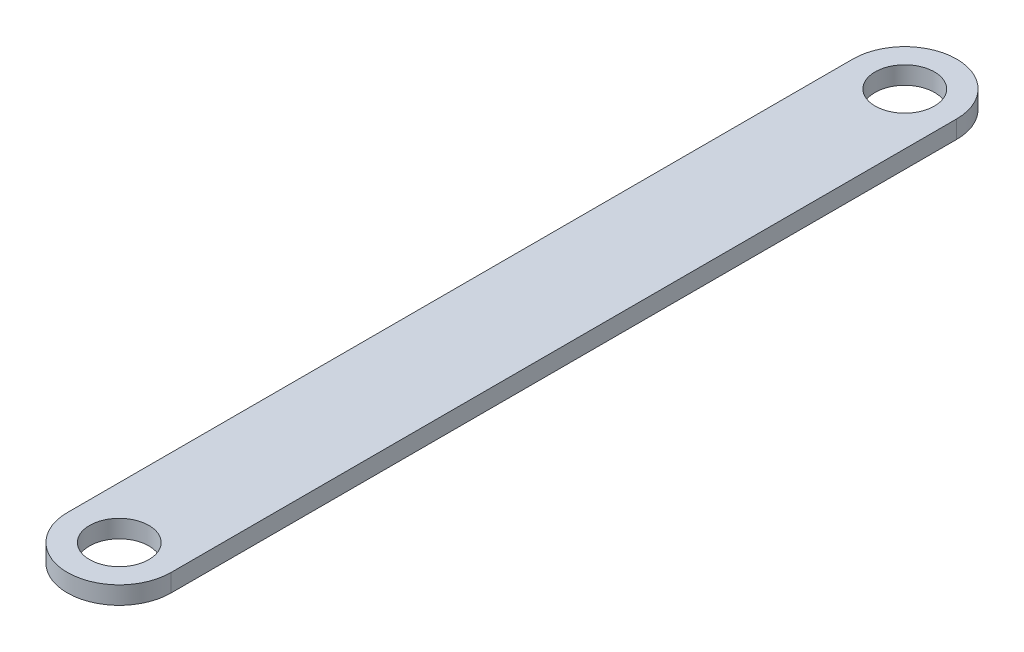
ISO-10303-21;
HEADER;
FILE_DESCRIPTION(('STEP AP214'),'2;1');
FILE_NAME('part.step','',(''),(''),'','','');
FILE_SCHEMA(('AUTOMOTIVE_DESIGN { 1 0 10303 214 1 1 1 1 }'));
ENDSEC;
DATA;
#1=APPLICATION_CONTEXT('core data for automotive mechanical design processes');
#2=APPLICATION_PROTOCOL_DEFINITION('international standard','automotive_design',2000,#1);
#3=PRODUCT_CONTEXT('',#1,'mechanical');
#4=PRODUCT('Part','Part','',(#3));
#5=PRODUCT_RELATED_PRODUCT_CATEGORY('part','',(#4));
#6=PRODUCT_DEFINITION_FORMATION('','',#4);
#7=PRODUCT_DEFINITION_CONTEXT('part definition',#1,'design');
#8=PRODUCT_DEFINITION('design','',#6,#7);
#9=PRODUCT_DEFINITION_SHAPE('','',#8);
#10=(LENGTH_UNIT() NAMED_UNIT(*) SI_UNIT(.MILLI.,.METRE.));
#11=(NAMED_UNIT(*) PLANE_ANGLE_UNIT() SI_UNIT($,.RADIAN.));
#12=(NAMED_UNIT(*) SI_UNIT($,.STERADIAN.) SOLID_ANGLE_UNIT());
#13=UNCERTAINTY_MEASURE_WITH_UNIT(LENGTH_MEASURE(1.E-05),#10,'distance_accuracy_value','');
#14=(GEOMETRIC_REPRESENTATION_CONTEXT(3) GLOBAL_UNCERTAINTY_ASSIGNED_CONTEXT((#13)) GLOBAL_UNIT_ASSIGNED_CONTEXT((#10,
#11,#12)) REPRESENTATION_CONTEXT('',''));
#15=CARTESIAN_POINT('',(0.,0.,0.));
#16=DIRECTION('',(0.,0.,1.));
#17=DIRECTION('',(1.,0.,0.));
#18=AXIS2_PLACEMENT_3D('',#15,#16,#17);
#19=CARTESIAN_POINT('',(-17.5,6.,0.));
#20=DIRECTION('',(1.,0.,0.));
#21=DIRECTION('',(0.,0.,-1.));
#22=AXIS2_PLACEMENT_3D('',#19,#20,#21);
#23=PLANE('',#22);
#24=DIRECTION('',(0.,0.,1.));
#25=VECTOR('',#24,1.);
#26=CARTESIAN_POINT('',(-17.5,0.,0.));
#27=LINE('',#26,#25);
#28=CARTESIAN_POINT('',(-17.5,0.,-132.5));
#29=VERTEX_POINT('',#28);
#30=CARTESIAN_POINT('',(-17.5,0.,132.5));
#31=VERTEX_POINT('',#30);
#32=EDGE_CURVE('E102',#29,#31,#27,.T.);
#33=ORIENTED_EDGE('',*,*,#32,.T.);
#34=DIRECTION('',(0.,-1.,0.));
#35=VECTOR('',#34,1.);
#36=CARTESIAN_POINT('',(-17.5,6.,132.5));
#37=LINE('',#36,#35);
#38=CARTESIAN_POINT('',(-17.5,6.,132.5));
#39=VERTEX_POINT('',#38);
#40=EDGE_CURVE('E11',#39,#31,#37,.T.);
#41=ORIENTED_EDGE('',*,*,#40,.F.);
#42=DIRECTION('',(0.,0.,1.));
#43=VECTOR('',#42,1.);
#44=CARTESIAN_POINT('',(-17.5,6.,0.));
#45=LINE('',#44,#43);
#46=CARTESIAN_POINT('',(-17.5,6.,-132.5));
#47=VERTEX_POINT('',#46);
#48=EDGE_CURVE('E72',#47,#39,#45,.T.);
#49=ORIENTED_EDGE('',*,*,#48,.F.);
#50=DIRECTION('',(0.,-1.,0.));
#51=VECTOR('',#50,1.);
#52=CARTESIAN_POINT('',(-17.5,6.,-132.5));
#53=LINE('',#52,#51);
#54=EDGE_CURVE('E101',#47,#29,#53,.T.);
#55=ORIENTED_EDGE('',*,*,#54,.T.);
#56=EDGE_LOOP('',(#33,#41,#49,#55));
#57=FACE_BOUND('',#56,.T.);
#58=ADVANCED_FACE('F33',(#57),#23,.F.);
#59=CARTESIAN_POINT('',(0.,6.,132.5));
#60=DIRECTION('',(0.,-1.,0.));
#61=DIRECTION('',(0.,0.,-1.));
#62=AXIS2_PLACEMENT_3D('',#59,#60,#61);
#63=CYLINDRICAL_SURFACE('',#62,17.5);
#64=CARTESIAN_POINT('',(0.,0.,132.5));
#65=DIRECTION('',(0.,1.,0.));
#66=DIRECTION('',(0.,0.,1.));
#67=AXIS2_PLACEMENT_3D('',#64,#65,#66);
#68=CIRCLE('',#67,17.5);
#69=CARTESIAN_POINT('',(17.5,0.,132.5));
#70=VERTEX_POINT('',#69);
#71=EDGE_CURVE('E81',#70,#31,#68,.F.);
#72=ORIENTED_EDGE('',*,*,#71,.F.);
#73=DIRECTION('',(0.,-1.,0.));
#74=VECTOR('',#73,1.);
#75=CARTESIAN_POINT('',(17.5,6.,132.5));
#76=LINE('',#75,#74);
#77=CARTESIAN_POINT('',(17.5,6.,132.5));
#78=VERTEX_POINT('',#77);
#79=EDGE_CURVE('E41',#78,#70,#76,.T.);
#80=ORIENTED_EDGE('',*,*,#79,.F.);
#81=CARTESIAN_POINT('',(0.,6.,132.5));
#82=DIRECTION('',(0.,1.,0.));
#83=DIRECTION('',(0.,0.,1.));
#84=AXIS2_PLACEMENT_3D('',#81,#82,#83);
#85=CIRCLE('',#84,17.5);
#86=EDGE_CURVE('E79',#78,#39,#85,.F.);
#87=ORIENTED_EDGE('',*,*,#86,.T.);
#88=ORIENTED_EDGE('',*,*,#40,.T.);
#89=EDGE_LOOP('',(#72,#80,#87,#88));
#90=FACE_BOUND('',#89,.T.);
#91=ADVANCED_FACE('F78',(#90),#63,.T.);
#92=CARTESIAN_POINT('',(17.5,6.,0.));
#93=DIRECTION('',(1.,0.,0.));
#94=DIRECTION('',(0.,0.,-1.));
#95=AXIS2_PLACEMENT_3D('',#92,#93,#94);
#96=PLANE('',#95);
#97=DIRECTION('',(0.,0.,1.));
#98=VECTOR('',#97,1.);
#99=CARTESIAN_POINT('',(17.5,0.,0.));
#100=LINE('',#99,#98);
#101=CARTESIAN_POINT('',(17.5,0.,-132.5));
#102=VERTEX_POINT('',#101);
#103=EDGE_CURVE('E106',#102,#70,#100,.T.);
#104=ORIENTED_EDGE('',*,*,#103,.F.);
#105=DIRECTION('',(0.,-1.,0.));
#106=VECTOR('',#105,1.);
#107=CARTESIAN_POINT('',(17.5,6.,-132.5));
#108=LINE('',#107,#106);
#109=CARTESIAN_POINT('',(17.5,6.,-132.5));
#110=VERTEX_POINT('',#109);
#111=EDGE_CURVE('E64',#110,#102,#108,.T.);
#112=ORIENTED_EDGE('',*,*,#111,.F.);
#113=DIRECTION('',(0.,0.,1.));
#114=VECTOR('',#113,1.);
#115=CARTESIAN_POINT('',(17.5,6.,0.));
#116=LINE('',#115,#114);
#117=EDGE_CURVE('E88',#110,#78,#116,.T.);
#118=ORIENTED_EDGE('',*,*,#117,.T.);
#119=ORIENTED_EDGE('',*,*,#79,.T.);
#120=EDGE_LOOP('',(#104,#112,#118,#119));
#121=FACE_BOUND('',#120,.T.);
#122=ADVANCED_FACE('F90',(#121),#96,.T.);
#123=CARTESIAN_POINT('',(0.,6.,-132.5));
#124=DIRECTION('',(0.,-1.,0.));
#125=DIRECTION('',(0.,0.,-1.));
#126=AXIS2_PLACEMENT_3D('',#123,#124,#125);
#127=CYLINDRICAL_SURFACE('',#126,10.);
#128=CARTESIAN_POINT('',(0.,6.,-132.5));
#129=DIRECTION('',(0.,1.,0.));
#130=DIRECTION('',(0.,0.,1.));
#131=AXIS2_PLACEMENT_3D('',#128,#129,#130);
#132=CIRCLE('',#131,10.);
#133=CARTESIAN_POINT('',(0.,6.,-122.5));
#134=VERTEX_POINT('',#133);
#135=EDGE_CURVE('E92',#134,#134,#132,.T.);
#136=ORIENTED_EDGE('',*,*,#135,.T.);
#137=EDGE_LOOP('',(#136));
#138=FACE_BOUND('',#137,.T.);
#139=CARTESIAN_POINT('',(0.,0.,-132.5));
#140=DIRECTION('',(0.,1.,0.));
#141=DIRECTION('',(0.,0.,1.));
#142=AXIS2_PLACEMENT_3D('',#139,#140,#141);
#143=CIRCLE('',#142,10.);
#144=CARTESIAN_POINT('',(0.,0.,-122.5));
#145=VERTEX_POINT('',#144);
#146=EDGE_CURVE('E109',#145,#145,#143,.T.);
#147=ORIENTED_EDGE('',*,*,#146,.F.);
#148=EDGE_LOOP('',(#147));
#149=FACE_BOUND('',#148,.T.);
#150=ADVANCED_FACE('F137',(#138,#149),#127,.F.);
#151=CARTESIAN_POINT('',(0.,6.,-132.5));
#152=DIRECTION('',(0.,-1.,0.));
#153=DIRECTION('',(0.,0.,-1.));
#154=AXIS2_PLACEMENT_3D('',#151,#152,#153);
#155=CYLINDRICAL_SURFACE('',#154,17.5);
#156=CARTESIAN_POINT('',(0.,0.,-132.5));
#157=DIRECTION('',(0.,1.,0.));
#158=DIRECTION('',(0.,0.,1.));
#159=AXIS2_PLACEMENT_3D('',#156,#157,#158);
#160=CIRCLE('',#159,17.5);
#161=EDGE_CURVE('E67',#102,#29,#160,.T.);
#162=ORIENTED_EDGE('',*,*,#161,.T.);
#163=ORIENTED_EDGE('',*,*,#54,.F.);
#164=CARTESIAN_POINT('',(0.,6.,-132.5));
#165=DIRECTION('',(0.,1.,0.));
#166=DIRECTION('',(0.,0.,1.));
#167=AXIS2_PLACEMENT_3D('',#164,#165,#166);
#168=CIRCLE('',#167,17.5);
#169=EDGE_CURVE('E49',#110,#47,#168,.T.);
#170=ORIENTED_EDGE('',*,*,#169,.F.);
#171=ORIENTED_EDGE('',*,*,#111,.T.);
#172=EDGE_LOOP('',(#162,#163,#170,#171));
#173=FACE_BOUND('',#172,.T.);
#174=ADVANCED_FACE('F129',(#173),#155,.T.);
#175=CARTESIAN_POINT('',(0.,6.,132.5));
#176=DIRECTION('',(0.,-1.,0.));
#177=DIRECTION('',(0.,0.,-1.));
#178=AXIS2_PLACEMENT_3D('',#175,#176,#177);
#179=CYLINDRICAL_SURFACE('',#178,10.);
#180=CARTESIAN_POINT('',(0.,6.,132.5));
#181=DIRECTION('',(0.,1.,0.));
#182=DIRECTION('',(0.,0.,1.));
#183=AXIS2_PLACEMENT_3D('',#180,#181,#182);
#184=CIRCLE('',#183,10.);
#185=CARTESIAN_POINT('',(0.,6.,142.5));
#186=VERTEX_POINT('',#185);
#187=EDGE_CURVE('E98',#186,#186,#184,.F.);
#188=ORIENTED_EDGE('',*,*,#187,.F.);
#189=EDGE_LOOP('',(#188));
#190=FACE_BOUND('',#189,.T.);
#191=CARTESIAN_POINT('',(0.,0.,132.5));
#192=DIRECTION('',(0.,1.,0.));
#193=DIRECTION('',(0.,0.,1.));
#194=AXIS2_PLACEMENT_3D('',#191,#192,#193);
#195=CIRCLE('',#194,10.);
#196=CARTESIAN_POINT('',(0.,0.,142.5));
#197=VERTEX_POINT('',#196);
#198=EDGE_CURVE('E112',#197,#197,#195,.F.);
#199=ORIENTED_EDGE('',*,*,#198,.T.);
#200=EDGE_LOOP('',(#199));
#201=FACE_BOUND('',#200,.T.);
#202=ADVANCED_FACE('F127',(#190,#201),#179,.F.);
#203=CARTESIAN_POINT('',(0.,6.,0.));
#204=DIRECTION('',(0.,1.,0.));
#205=DIRECTION('',(0.,0.,1.));
#206=AXIS2_PLACEMENT_3D('',#203,#204,#205);
#207=PLANE('',#206);
#208=ORIENTED_EDGE('',*,*,#48,.T.);
#209=ORIENTED_EDGE('',*,*,#86,.F.);
#210=ORIENTED_EDGE('',*,*,#117,.F.);
#211=ORIENTED_EDGE('',*,*,#169,.T.);
#212=EDGE_LOOP('',(#208,#209,#210,#211));
#213=FACE_BOUND('',#212,.T.);
#214=ORIENTED_EDGE('',*,*,#135,.F.);
#215=EDGE_LOOP('',(#214));
#216=FACE_BOUND('',#215,.T.);
#217=ORIENTED_EDGE('',*,*,#187,.T.);
#218=EDGE_LOOP('',(#217));
#219=FACE_BOUND('',#218,.T.);
#220=ADVANCED_FACE('F86',(#213,#216,#219),#207,.T.);
#221=CARTESIAN_POINT('',(0.,0.,0.));
#222=DIRECTION('',(0.,1.,0.));
#223=DIRECTION('',(0.,0.,1.));
#224=AXIS2_PLACEMENT_3D('',#221,#222,#223);
#225=PLANE('',#224);
#226=ORIENTED_EDGE('',*,*,#32,.F.);
#227=ORIENTED_EDGE('',*,*,#161,.F.);
#228=ORIENTED_EDGE('',*,*,#103,.T.);
#229=ORIENTED_EDGE('',*,*,#71,.T.);
#230=EDGE_LOOP('',(#226,#227,#228,#229));
#231=FACE_BOUND('',#230,.T.);
#232=ORIENTED_EDGE('',*,*,#146,.T.);
#233=EDGE_LOOP('',(#232));
#234=FACE_BOUND('',#233,.T.);
#235=ORIENTED_EDGE('',*,*,#198,.F.);
#236=EDGE_LOOP('',(#235));
#237=FACE_BOUND('',#236,.T.);
#238=ADVANCED_FACE('F119',(#231,#234,#237),#225,.F.);
#239=CLOSED_SHELL('',(#58,#91,#122,#150,#174,#202,#220,#238));
#240=MANIFOLD_SOLID_BREP('B2',#239);
#241=ADVANCED_BREP_SHAPE_REPRESENTATION('',(#18,#240),#14);
#242=SHAPE_DEFINITION_REPRESENTATION(#9,#241);
ENDSEC;
END-ISO-10303-21;
